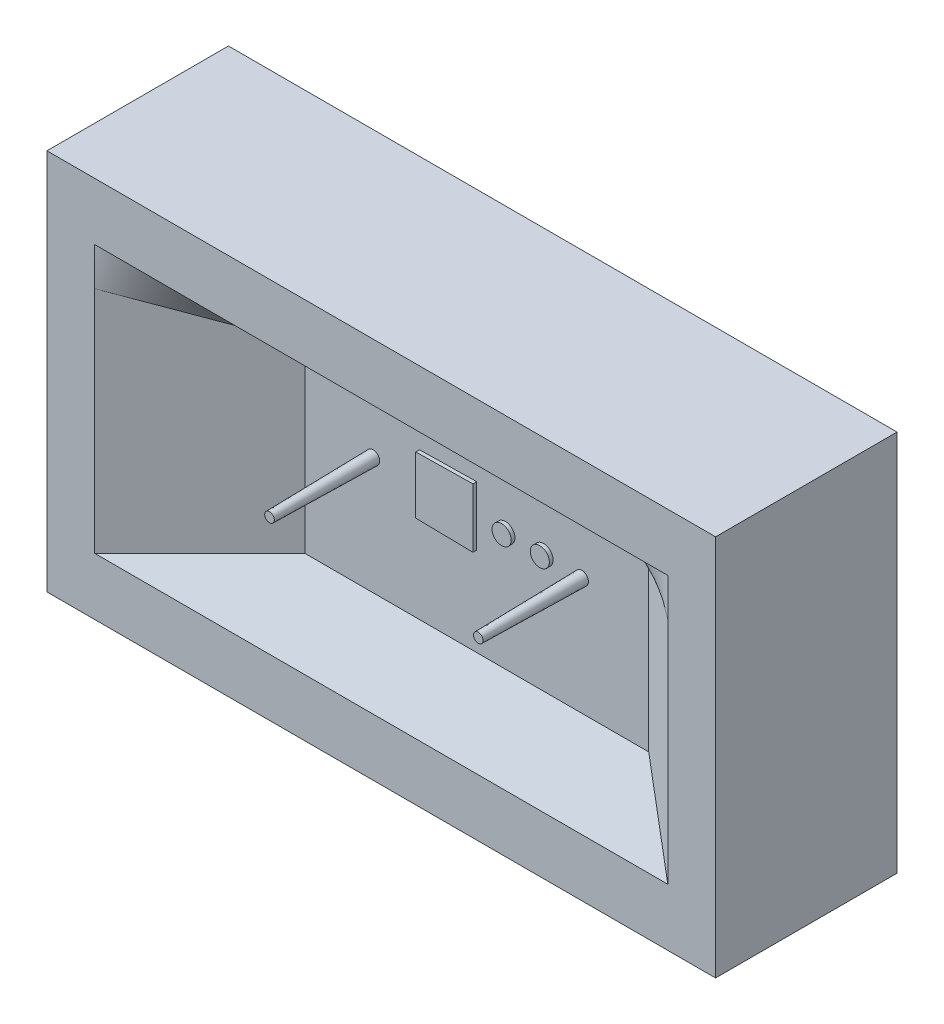
ISO-10303-21;
HEADER;
FILE_DESCRIPTION(('STEP AP214'),'2;1');
FILE_NAME('part.step','',(''),(''),'','','');
FILE_SCHEMA(('AUTOMOTIVE_DESIGN { 1 0 10303 214 1 1 1 1 }'));
ENDSEC;
DATA;
#1=APPLICATION_CONTEXT('core data for automotive mechanical design processes');
#2=APPLICATION_PROTOCOL_DEFINITION('international standard','automotive_design',2000,#1);
#3=PRODUCT_CONTEXT('',#1,'mechanical');
#4=PRODUCT('Part','Part','',(#3));
#5=PRODUCT_RELATED_PRODUCT_CATEGORY('part','',(#4));
#6=PRODUCT_DEFINITION_FORMATION('','',#4);
#7=PRODUCT_DEFINITION_CONTEXT('part definition',#1,'design');
#8=PRODUCT_DEFINITION('design','',#6,#7);
#9=PRODUCT_DEFINITION_SHAPE('','',#8);
#10=(LENGTH_UNIT() NAMED_UNIT(*) SI_UNIT(.MILLI.,.METRE.));
#11=(NAMED_UNIT(*) PLANE_ANGLE_UNIT() SI_UNIT($,.RADIAN.));
#12=(NAMED_UNIT(*) SI_UNIT($,.STERADIAN.) SOLID_ANGLE_UNIT());
#13=UNCERTAINTY_MEASURE_WITH_UNIT(LENGTH_MEASURE(1.E-05),#10,'distance_accuracy_value','');
#14=(GEOMETRIC_REPRESENTATION_CONTEXT(3) GLOBAL_UNCERTAINTY_ASSIGNED_CONTEXT((#13)) GLOBAL_UNIT_ASSIGNED_CONTEXT((#10,
#11,#12)) REPRESENTATION_CONTEXT('',''));
#15=CARTESIAN_POINT('',(0.,0.,0.));
#16=DIRECTION('',(0.,0.,1.));
#17=DIRECTION('',(1.,0.,0.));
#18=AXIS2_PLACEMENT_3D('',#15,#16,#17);
#19=CARTESIAN_POINT('',(-174.999999872721,29.9999996912032,47.0000000000001));
#20=DIRECTION('',(-1.,0.,0.));
#21=DIRECTION('',(0.,-1.,0.));
#22=AXIS2_PLACEMENT_3D('',#19,#20,#21);
#23=PLANE('',#22);
#24=DIRECTION('',(0.,-1.,0.));
#25=VECTOR('',#24,1.);
#26=CARTESIAN_POINT('',(-174.999999872721,29.9999996912033,1.11022302462516E-13));
#27=LINE('',#26,#25);
#28=CARTESIAN_POINT('',(-174.999999872721,29.9999996912032,1.11022302462516E-13));
#29=VERTEX_POINT('',#28);
#30=CARTESIAN_POINT('',(-174.999999872721,-170.000000308797,-6.03683769639929E-13));
#31=VERTEX_POINT('',#30);
#32=EDGE_CURVE('E243',#29,#31,#27,.T.);
#33=ORIENTED_EDGE('',*,*,#32,.F.);
#34=DIRECTION('',(0.,0.,-1.));
#35=VECTOR('',#34,1.);
#36=CARTESIAN_POINT('',(-174.999999872721,29.9999996912032,47.0000000000001));
#37=LINE('',#36,#35);
#38=CARTESIAN_POINT('',(-174.999999872721,29.9999996912032,-94.9999999999999));
#39=VERTEX_POINT('',#38);
#40=EDGE_CURVE('E198',#29,#39,#37,.T.);
#41=ORIENTED_EDGE('',*,*,#40,.T.);
#42=DIRECTION('',(0.,1.,0.));
#43=VECTOR('',#42,1.);
#44=CARTESIAN_POINT('',(-174.999999872721,29.9999996912032,-94.9999999999999));
#45=LINE('',#44,#43);
#46=CARTESIAN_POINT('',(-174.999999872721,-170.000000308797,-95.0000000000006));
#47=VERTEX_POINT('',#46);
#48=EDGE_CURVE('E256',#47,#39,#45,.T.);
#49=ORIENTED_EDGE('',*,*,#48,.F.);
#50=DIRECTION('',(0.,0.,-1.));
#51=VECTOR('',#50,1.);
#52=CARTESIAN_POINT('',(-174.999999872721,-170.000000308797,46.9999999999994));
#53=LINE('',#52,#51);
#54=EDGE_CURVE('E249',#31,#47,#53,.T.);
#55=ORIENTED_EDGE('',*,*,#54,.F.);
#56=EDGE_LOOP('',(#33,#41,#49,#55));
#57=FACE_BOUND('',#56,.T.);
#58=ADVANCED_FACE('F38',(#57),#23,.T.);
#59=CARTESIAN_POINT('',(-174.999999872721,-170.000000308797,46.9999999999994));
#60=DIRECTION('',(0.,-1.,0.));
#61=DIRECTION('',(1.,0.,0.));
#62=AXIS2_PLACEMENT_3D('',#59,#60,#61);
#63=PLANE('',#62);
#64=DIRECTION('',(1.,0.,0.));
#65=VECTOR('',#64,1.);
#66=CARTESIAN_POINT('',(-174.999999872721,-170.000000308797,-6.03683769639929E-13));
#67=LINE('',#66,#65);
#68=CARTESIAN_POINT('',(175.000000127279,-170.000000308797,-2.42861286636753E-13));
#69=VERTEX_POINT('',#68);
#70=EDGE_CURVE('E240',#31,#69,#67,.T.);
#71=ORIENTED_EDGE('',*,*,#70,.F.);
#72=ORIENTED_EDGE('',*,*,#54,.T.);
#73=DIRECTION('',(-1.,0.,0.));
#74=VECTOR('',#73,1.);
#75=CARTESIAN_POINT('',(-174.999999872721,-170.000000308797,-95.0000000000006));
#76=LINE('',#75,#74);
#77=CARTESIAN_POINT('',(175.000000127279,-170.000000308797,-95.0000000000006));
#78=VERTEX_POINT('',#77);
#79=EDGE_CURVE('E232',#78,#47,#76,.T.);
#80=ORIENTED_EDGE('',*,*,#79,.F.);
#81=DIRECTION('',(0.,0.,-1.));
#82=VECTOR('',#81,1.);
#83=CARTESIAN_POINT('',(175.000000127279,-170.000000308797,46.9999999999994));
#84=LINE('',#83,#82);
#85=EDGE_CURVE('E252',#69,#78,#84,.T.);
#86=ORIENTED_EDGE('',*,*,#85,.F.);
#87=EDGE_LOOP('',(#71,#72,#80,#86));
#88=FACE_BOUND('',#87,.T.);
#89=ADVANCED_FACE('F324',(#88),#63,.T.);
#90=CARTESIAN_POINT('',(175.000000127279,29.9999996912031,47.0000000000001));
#91=DIRECTION('',(1.,0.,0.));
#92=DIRECTION('',(0.,1.,0.));
#93=AXIS2_PLACEMENT_3D('',#90,#91,#92);
#94=PLANE('',#93);
#95=DIRECTION('',(0.,1.,0.));
#96=VECTOR('',#95,1.);
#97=CARTESIAN_POINT('',(175.000000127279,29.9999996912033,1.11022302462516E-13));
#98=LINE('',#97,#96);
#99=CARTESIAN_POINT('',(175.000000127279,29.9999996912031,1.11022302462516E-13));
#100=VERTEX_POINT('',#99);
#101=EDGE_CURVE('E50',#69,#100,#98,.T.);
#102=ORIENTED_EDGE('',*,*,#101,.F.);
#103=ORIENTED_EDGE('',*,*,#85,.T.);
#104=DIRECTION('',(0.,-1.,0.));
#105=VECTOR('',#104,1.);
#106=CARTESIAN_POINT('',(175.000000127279,29.9999996912031,-94.9999999999999));
#107=LINE('',#106,#105);
#108=CARTESIAN_POINT('',(175.000000127279,29.9999996912031,-94.9999999999999));
#109=VERTEX_POINT('',#108);
#110=EDGE_CURVE('E271',#109,#78,#107,.T.);
#111=ORIENTED_EDGE('',*,*,#110,.F.);
#112=DIRECTION('',(0.,0.,-1.));
#113=VECTOR('',#112,1.);
#114=CARTESIAN_POINT('',(175.000000127279,29.9999996912031,47.0000000000001));
#115=LINE('',#114,#113);
#116=EDGE_CURVE('E254',#100,#109,#115,.T.);
#117=ORIENTED_EDGE('',*,*,#116,.F.);
#118=EDGE_LOOP('',(#102,#103,#111,#117));
#119=FACE_BOUND('',#118,.T.);
#120=ADVANCED_FACE('F330',(#119),#94,.T.);
#121=CARTESIAN_POINT('',(-174.999999872721,29.9999996912032,47.0000000000001));
#122=DIRECTION('',(0.,1.,0.));
#123=DIRECTION('',(-1.,0.,0.));
#124=AXIS2_PLACEMENT_3D('',#121,#122,#123);
#125=PLANE('',#124);
#126=DIRECTION('',(-1.,0.,0.));
#127=VECTOR('',#126,1.);
#128=CARTESIAN_POINT('',(-174.999999872721,29.9999996912032,1.11022302462516E-13));
#129=LINE('',#128,#127);
#130=EDGE_CURVE('E246',#100,#29,#129,.T.);
#131=ORIENTED_EDGE('',*,*,#130,.F.);
#132=ORIENTED_EDGE('',*,*,#116,.T.);
#133=DIRECTION('',(1.,0.,0.));
#134=VECTOR('',#133,1.);
#135=CARTESIAN_POINT('',(-174.999999872721,29.9999996912032,-94.9999999999999));
#136=LINE('',#135,#134);
#137=EDGE_CURVE('E264',#39,#109,#136,.T.);
#138=ORIENTED_EDGE('',*,*,#137,.F.);
#139=ORIENTED_EDGE('',*,*,#40,.F.);
#140=EDGE_LOOP('',(#131,#132,#138,#139));
#141=FACE_BOUND('',#140,.T.);
#142=ADVANCED_FACE('F759',(#141),#125,.T.);
#143=CARTESIAN_POINT('',(0.,0.,-95.));
#144=DIRECTION('',(0.,0.,1.));
#145=DIRECTION('',(0.,-1.,0.));
#146=AXIS2_PLACEMENT_3D('',#143,#144,#145);
#147=PLANE('',#146);
#148=ORIENTED_EDGE('',*,*,#48,.T.);
#149=ORIENTED_EDGE('',*,*,#137,.T.);
#150=ORIENTED_EDGE('',*,*,#110,.T.);
#151=ORIENTED_EDGE('',*,*,#79,.T.);
#152=EDGE_LOOP('',(#148,#149,#150,#151));
#153=FACE_BOUND('',#152,.T.);
#154=ADVANCED_FACE('F340',(#153),#147,.F.);
#155=CARTESIAN_POINT('',(0.,0.,4.22143622850085));
#156=DIRECTION('',(0.,0.,1.));
#157=DIRECTION('',(1.,0.,0.));
#158=AXIS2_PLACEMENT_3D('',#155,#156,#157);
#159=PLANE('',#158);
#160=CARTESIAN_POINT('',(-54.2759001296374,-73.6409301068171,4.22143622850085));
#161=DIRECTION('',(0.,0.,1.));
#162=DIRECTION('',(1.,0.,0.));
#163=AXIS2_PLACEMENT_3D('',#160,#161,#162);
#164=CIRCLE('',#163,2.51152856001326);
#165=CARTESIAN_POINT('',(-51.7643715696241,-73.6409301068171,4.22143622850085));
#166=VERTEX_POINT('',#165);
#167=EDGE_CURVE('E164',#166,#166,#164,.F.);
#168=ORIENTED_EDGE('',*,*,#167,.F.);
#169=EDGE_LOOP('',(#168));
#170=FACE_BOUND('',#169,.T.);
#171=ADVANCED_FACE('F336',(#170),#159,.T.);
#172=CARTESIAN_POINT('',(59.0652003015943,-56.445361145891,-48.));
#173=DIRECTION('',(0.0174497483512505,-0.999695413509548,0.0174524064372835));
#174=DIRECTION('',(0.,-0.0174550641182922,-0.999847648762863));
#175=AXIS2_PLACEMENT_3D('',#172,#173,#174);
#176=PLANE('',#175);
#177=DIRECTION('',(0.0174498403013456,-0.0171479103059381,-0.999700681326965));
#178=VECTOR('',#177,1.);
#179=CARTESIAN_POINT('',(-29.9844401285903,-58.0152906430487,-48.8914244360414));
#180=LINE('',#179,#178);
#181=CARTESIAN_POINT('',(-30.,-58.,-48.));
#182=VERTEX_POINT('',#181);
#183=CARTESIAN_POINT('',(-29.9650898701436,-58.0343060890649,-50.));
#184=VERTEX_POINT('',#183);
#185=EDGE_CURVE('E182',#182,#184,#180,.T.);
#186=ORIENTED_EDGE('',*,*,#185,.F.);
#187=DIRECTION('',(-0.999847695156391,-0.0174524064372835,0.));
#188=VECTOR('',#187,1.);
#189=CARTESIAN_POINT('',(59.0652003015943,-56.445361145891,-48.));
#190=LINE('',#189,#188);
#191=CARTESIAN_POINT('',(0.,-57.4763480521535,-48.));
#192=VERTEX_POINT('',#191);
#193=EDGE_CURVE('E228',#182,#192,#190,.F.);
#194=ORIENTED_EDGE('',*,*,#193,.T.);
#195=DIRECTION('',(-0.0174496547837706,-0.0177568977127763,-0.999690053032211));
#196=VECTOR('',#195,1.);
#197=CARTESIAN_POINT('',(0.0183042426233904,-57.4577215195371,-46.9513506424258));
#198=LINE('',#197,#196);
#199=CARTESIAN_POINT('',(-0.0349101298564354,-57.511872858385,-50.));
#200=VERTEX_POINT('',#199);
#201=EDGE_CURVE('E225',#192,#200,#198,.T.);
#202=ORIENTED_EDGE('',*,*,#201,.T.);
#203=DIRECTION('',(-0.999847695156391,-0.0174524064372835,0.));
#204=VECTOR('',#203,1.);
#205=CARTESIAN_POINT('',(59.0658095673693,-56.4802659587655,-50.));
#206=LINE('',#205,#204);
#207=EDGE_CURVE('E187',#184,#200,#206,.F.);
#208=ORIENTED_EDGE('',*,*,#207,.F.);
#209=EDGE_LOOP('',(#186,#194,#202,#208));
#210=FACE_BOUND('',#209,.T.);
#211=ADVANCED_FACE('F339',(#210),#176,.F.);
#212=CARTESIAN_POINT('',(0.,-110.,-48.));
#213=DIRECTION('',(-0.999847695156391,0.,0.0174524064372835));
#214=DIRECTION('',(0.0174524064372835,0.,0.999847695156391));
#215=AXIS2_PLACEMENT_3D('',#212,#213,#214);
#216=PLANE('',#215);
#217=ORIENTED_EDGE('',*,*,#201,.F.);
#218=DIRECTION('',(0.,-1.,0.));
#219=VECTOR('',#218,1.);
#220=CARTESIAN_POINT('',(0.,-110.,-48.));
#221=LINE('',#220,#219);
#222=CARTESIAN_POINT('',(0.,-88.5236519478465,-48.));
#223=VERTEX_POINT('',#222);
#224=EDGE_CURVE('E216',#192,#223,#221,.T.);
#225=ORIENTED_EDGE('',*,*,#224,.T.);
#226=DIRECTION('',(-0.0174496547837706,0.0177568977127763,-0.999690053032211));
#227=VECTOR('',#226,1.);
#228=CARTESIAN_POINT('',(0.00665448370796812,-88.5304235996642,-47.6187648836978));
#229=LINE('',#228,#227);
#230=CARTESIAN_POINT('',(-0.0349101298564394,-88.488127141615,-50.));
#231=VERTEX_POINT('',#230);
#232=EDGE_CURVE('E210',#223,#231,#229,.T.);
#233=ORIENTED_EDGE('',*,*,#232,.T.);
#234=DIRECTION('',(0.,1.,0.));
#235=VECTOR('',#234,1.);
#236=CARTESIAN_POINT('',(-0.0349101298564441,-110.,-50.));
#237=LINE('',#236,#235);
#238=EDGE_CURVE('E211',#200,#231,#237,.F.);
#239=ORIENTED_EDGE('',*,*,#238,.F.);
#240=EDGE_LOOP('',(#217,#225,#233,#239));
#241=FACE_BOUND('',#240,.T.);
#242=ADVANCED_FACE('F344',(#241),#216,.F.);
#243=CARTESIAN_POINT('',(60.3564816795868,-89.5771782544025,-48.));
#244=DIRECTION('',(0.0174497483512505,0.999695413509548,0.0174524064372835));
#245=DIRECTION('',(0.,-0.0174550641182922,0.999847648762863));
#246=AXIS2_PLACEMENT_3D('',#243,#244,#245);
#247=PLANE('',#246);
#248=ORIENTED_EDGE('',*,*,#232,.F.);
#249=DIRECTION('',(0.999847695156391,-0.0174524064372835,0.));
#250=VECTOR('',#249,1.);
#251=CARTESIAN_POINT('',(60.3564816795868,-89.5771782544025,-48.));
#252=LINE('',#251,#250);
#253=CARTESIAN_POINT('',(-30.,-88.,-48.));
#254=VERTEX_POINT('',#253);
#255=EDGE_CURVE('E206',#223,#254,#252,.F.);
#256=ORIENTED_EDGE('',*,*,#255,.T.);
#257=DIRECTION('',(0.0174498403013456,0.0171479103059381,-0.999700681326965));
#258=VECTOR('',#257,1.);
#259=CARTESIAN_POINT('',(-29.9729586653975,-87.9734265544951,-49.5491970218237));
#260=LINE('',#259,#258);
#261=CARTESIAN_POINT('',(-29.9650898701436,-87.9656939109351,-50.));
#262=VERTEX_POINT('',#261);
#263=EDGE_CURVE('E193',#254,#262,#260,.T.);
#264=ORIENTED_EDGE('',*,*,#263,.T.);
#265=DIRECTION('',(0.999847695156391,-0.0174524064372835,0.));
#266=VECTOR('',#265,1.);
#267=CARTESIAN_POINT('',(60.3570909453619,-89.5422734415279,-50.));
#268=LINE('',#267,#266);
#269=EDGE_CURVE('E154',#231,#262,#268,.F.);
#270=ORIENTED_EDGE('',*,*,#269,.F.);
#271=EDGE_LOOP('',(#248,#256,#264,#270));
#272=FACE_BOUND('',#271,.T.);
#273=ADVANCED_FACE('F348',(#272),#247,.F.);
#274=CARTESIAN_POINT('',(-30.,-110.,-48.));
#275=DIRECTION('',(0.999847695156391,0.,0.0174524064372835));
#276=DIRECTION('',(0.0174524064372835,0.,-0.999847695156391));
#277=AXIS2_PLACEMENT_3D('',#274,#275,#276);
#278=PLANE('',#277);
#279=ORIENTED_EDGE('',*,*,#263,.F.);
#280=DIRECTION('',(0.,1.,0.));
#281=VECTOR('',#280,1.);
#282=CARTESIAN_POINT('',(-30.,-110.,-48.));
#283=LINE('',#282,#281);
#284=EDGE_CURVE('E188',#254,#182,#283,.T.);
#285=ORIENTED_EDGE('',*,*,#284,.T.);
#286=ORIENTED_EDGE('',*,*,#185,.T.);
#287=DIRECTION('',(0.,-1.,0.));
#288=VECTOR('',#287,1.);
#289=CARTESIAN_POINT('',(-29.9650898701436,-110.,-50.));
#290=LINE('',#289,#288);
#291=EDGE_CURVE('E185',#262,#184,#290,.F.);
#292=ORIENTED_EDGE('',*,*,#291,.F.);
#293=EDGE_LOOP('',(#279,#285,#286,#292));
#294=FACE_BOUND('',#293,.T.);
#295=ADVANCED_FACE('F352',(#294),#278,.F.);
#296=CARTESIAN_POINT('',(35.,-73.,-48.));
#297=DIRECTION('',(0.,0.,1.));
#298=DIRECTION('',(-1.,0.,0.));
#299=AXIS2_PLACEMENT_3D('',#296,#297,#298);
#300=CONICAL_SURFACE('',#299,5.,0.0174532925199433);
#301=CARTESIAN_POINT('',(35.,-73.,-50.));
#302=DIRECTION('',(0.,0.,-1.));
#303=DIRECTION('',(-1.,0.,0.));
#304=AXIS2_PLACEMENT_3D('',#301,#302,#303);
#305=CIRCLE('',#304,4.96508987014356);
#306=CARTESIAN_POINT('',(30.0349101298564,-73.,-50.));
#307=VERTEX_POINT('',#306);
#308=EDGE_CURVE('E178',#307,#307,#305,.T.);
#309=ORIENTED_EDGE('',*,*,#308,.F.);
#310=EDGE_LOOP('',(#309));
#311=FACE_BOUND('',#310,.T.);
#312=CARTESIAN_POINT('',(35.,-73.,-48.));
#313=DIRECTION('',(0.,0.,-1.));
#314=DIRECTION('',(-1.,0.,0.));
#315=AXIS2_PLACEMENT_3D('',#312,#313,#314);
#316=CIRCLE('',#315,5.);
#317=CARTESIAN_POINT('',(30.,-73.,-48.));
#318=VERTEX_POINT('',#317);
#319=EDGE_CURVE('E175',#318,#318,#316,.T.);
#320=ORIENTED_EDGE('',*,*,#319,.T.);
#321=EDGE_LOOP('',(#320));
#322=FACE_BOUND('',#321,.T.);
#323=ADVANCED_FACE('F356',(#311,#322),#300,.T.);
#324=CARTESIAN_POINT('',(15.,-73.,-48.));
#325=DIRECTION('',(0.,0.,1.));
#326=DIRECTION('',(-1.,0.,0.));
#327=AXIS2_PLACEMENT_3D('',#324,#325,#326);
#328=CONICAL_SURFACE('',#327,5.,0.0174532925199433);
#329=CARTESIAN_POINT('',(15.,-73.,-50.));
#330=DIRECTION('',(0.,0.,-1.));
#331=DIRECTION('',(-1.,0.,0.));
#332=AXIS2_PLACEMENT_3D('',#329,#330,#331);
#333=CIRCLE('',#332,4.96508987014357);
#334=CARTESIAN_POINT('',(10.0349101298564,-73.,-50.));
#335=VERTEX_POINT('',#334);
#336=EDGE_CURVE('E170',#335,#335,#333,.T.);
#337=ORIENTED_EDGE('',*,*,#336,.F.);
#338=EDGE_LOOP('',(#337));
#339=FACE_BOUND('',#338,.T.);
#340=CARTESIAN_POINT('',(15.,-73.,-48.));
#341=DIRECTION('',(0.,0.,-1.));
#342=DIRECTION('',(-1.,0.,0.));
#343=AXIS2_PLACEMENT_3D('',#340,#341,#342);
#344=CIRCLE('',#343,5.);
#345=CARTESIAN_POINT('',(9.99999999999999,-73.,-48.));
#346=VERTEX_POINT('',#345);
#347=EDGE_CURVE('E171',#346,#346,#344,.T.);
#348=ORIENTED_EDGE('',*,*,#347,.T.);
#349=EDGE_LOOP('',(#348));
#350=FACE_BOUND('',#349,.T.);
#351=ADVANCED_FACE('F360',(#339,#350),#328,.T.);
#352=CARTESIAN_POINT('',(-54.2759001296374,-73.6409301068171,4.88190698931831));
#353=DIRECTION('',(0.,0.,-1.));
#354=DIRECTION('',(0.894427190999916,-0.447213595499958,0.));
#355=AXIS2_PLACEMENT_3D('',#352,#353,#354);
#356=CONICAL_SURFACE('',#355,2.5,0.0174532925199433);
#357=CARTESIAN_POINT('',(-54.2759001296374,-73.6409301068171,-50.));
#358=DIRECTION('',(0.,0.,-1.));
#359=DIRECTION('',(-1.,0.,0.));
#360=AXIS2_PLACEMENT_3D('',#357,#358,#359);
#361=CIRCLE('',#360,3.45796724988295);
#362=CARTESIAN_POINT('',(-57.7338673795203,-73.6409301068171,-50.));
#363=VERTEX_POINT('',#362);
#364=EDGE_CURVE('E167',#363,#363,#361,.T.);
#365=ORIENTED_EDGE('',*,*,#364,.F.);
#366=EDGE_LOOP('',(#365));
#367=FACE_BOUND('',#366,.T.);
#368=ORIENTED_EDGE('',*,*,#167,.T.);
#369=EDGE_LOOP('',(#368));
#370=FACE_BOUND('',#369,.T.);
#371=ADVANCED_FACE('F364',(#367,#370),#356,.T.);
#372=CARTESIAN_POINT('',(55.,-73.6409301068171,4.88190698931831));
#373=DIRECTION('',(0.,0.,-1.));
#374=DIRECTION('',(0.894427190999916,-0.447213595499958,0.));
#375=AXIS2_PLACEMENT_3D('',#372,#373,#374);
#376=CONICAL_SURFACE('',#375,2.5,0.0174532925199433);
#377=CARTESIAN_POINT('',(55.,-73.6409301068171,-50.));
#378=DIRECTION('',(0.,0.,-1.));
#379=DIRECTION('',(-1.,0.,0.));
#380=AXIS2_PLACEMENT_3D('',#377,#378,#379);
#381=CIRCLE('',#380,3.45796724988295);
#382=CARTESIAN_POINT('',(51.542032750117,-73.6409301068171,-50.));
#383=VERTEX_POINT('',#382);
#384=EDGE_CURVE('E163',#383,#383,#381,.T.);
#385=ORIENTED_EDGE('',*,*,#384,.F.);
#386=EDGE_LOOP('',(#385));
#387=FACE_BOUND('',#386,.T.);
#388=CARTESIAN_POINT('',(55.,-73.6409301068171,4.22143622850085));
#389=DIRECTION('',(0.,0.,-1.));
#390=DIRECTION('',(-1.,0.,0.));
#391=AXIS2_PLACEMENT_3D('',#388,#389,#390);
#392=CIRCLE('',#391,2.51152856001326);
#393=CARTESIAN_POINT('',(52.4884714399867,-73.6409301068171,4.22143622850085));
#394=VERTEX_POINT('',#393);
#395=EDGE_CURVE('E159',#394,#394,#392,.T.);
#396=ORIENTED_EDGE('',*,*,#395,.T.);
#397=EDGE_LOOP('',(#396));
#398=FACE_BOUND('',#397,.T.);
#399=ADVANCED_FACE('F368',(#387,#398),#376,.T.);
#400=CARTESIAN_POINT('',(60.,-110.,-50.));
#401=DIRECTION('',(0.,0.,-1.));
#402=DIRECTION('',(-1.,0.,0.));
#403=AXIS2_PLACEMENT_3D('',#400,#401,#402);
#404=PLANE('',#403);
#405=ORIENTED_EDGE('',*,*,#384,.T.);
#406=EDGE_LOOP('',(#405));
#407=FACE_BOUND('',#406,.T.);
#408=ORIENTED_EDGE('',*,*,#364,.T.);
#409=EDGE_LOOP('',(#408));
#410=FACE_BOUND('',#409,.T.);
#411=ORIENTED_EDGE('',*,*,#336,.T.);
#412=EDGE_LOOP('',(#411));
#413=FACE_BOUND('',#412,.T.);
#414=ORIENTED_EDGE('',*,*,#308,.T.);
#415=EDGE_LOOP('',(#414));
#416=FACE_BOUND('',#415,.T.);
#417=ORIENTED_EDGE('',*,*,#291,.T.);
#418=ORIENTED_EDGE('',*,*,#207,.T.);
#419=ORIENTED_EDGE('',*,*,#238,.T.);
#420=ORIENTED_EDGE('',*,*,#269,.T.);
#421=EDGE_LOOP('',(#417,#418,#419,#420));
#422=FACE_BOUND('',#421,.T.);
#423=DIRECTION('',(-1.,0.,0.));
#424=VECTOR('',#423,1.);
#425=CARTESIAN_POINT('',(75.,-135.,-50.));
#426=LINE('',#425,#424);
#427=CARTESIAN_POINT('',(90.,-135.,-50.));
#428=VERTEX_POINT('',#427);
#429=CARTESIAN_POINT('',(-90.,-135.,-50.));
#430=VERTEX_POINT('',#429);
#431=EDGE_CURVE('E155',#428,#430,#426,.T.);
#432=ORIENTED_EDGE('',*,*,#431,.F.);
#433=DIRECTION('',(0.,1.,0.));
#434=VECTOR('',#433,1.);
#435=CARTESIAN_POINT('',(90.,-87.5,-50.));
#436=LINE('',#435,#434);
#437=CARTESIAN_POINT('',(90.,-40.,-50.));
#438=VERTEX_POINT('',#437);
#439=EDGE_CURVE('E152',#428,#438,#436,.T.);
#440=ORIENTED_EDGE('',*,*,#439,.T.);
#441=DIRECTION('',(-1.,0.,0.));
#442=VECTOR('',#441,1.);
#443=CARTESIAN_POINT('',(0.,-40.,-50.));
#444=LINE('',#443,#442);
#445=CARTESIAN_POINT('',(-90.,-40.,-50.));
#446=VERTEX_POINT('',#445);
#447=EDGE_CURVE('E124',#438,#446,#444,.T.);
#448=ORIENTED_EDGE('',*,*,#447,.T.);
#449=DIRECTION('',(0.,1.,0.));
#450=VECTOR('',#449,1.);
#451=CARTESIAN_POINT('',(-90.,-87.5,-50.));
#452=LINE('',#451,#450);
#453=EDGE_CURVE('E146',#430,#446,#452,.T.);
#454=ORIENTED_EDGE('',*,*,#453,.F.);
#455=EDGE_LOOP('',(#432,#440,#448,#454));
#456=FACE_BOUND('',#455,.T.);
#457=ADVANCED_FACE('F303',(#407,#410,#413,#416,#422,#456),#404,.F.);
#458=CARTESIAN_POINT('',(90.,-40.,-50.));
#459=DIRECTION('',(0.,0.581238193719097,-0.813733471206735));
#460=DIRECTION('',(-1.,0.,0.));
#461=AXIS2_PLACEMENT_3D('',#458,#459,#460);
#462=PLANE('',#461);
#463=ORIENTED_EDGE('',*,*,#447,.F.);
#464=DIRECTION('',(-0.329292779969071,0.768349819927832,0.548821299948452));
#465=VECTOR('',#464,1.);
#466=CARTESIAN_POINT('',(82.5,-22.5,-37.5));
#467=LINE('',#466,#465);
#468=CARTESIAN_POINT('',(75.,-5.,-25.));
#469=VERTEX_POINT('',#468);
#470=EDGE_CURVE('E117',#438,#469,#467,.T.);
#471=ORIENTED_EDGE('',*,*,#470,.T.);
#472=DIRECTION('',(-1.,0.,0.));
#473=VECTOR('',#472,1.);
#474=CARTESIAN_POINT('',(0.,-5.00000000000001,-25.));
#475=LINE('',#474,#473);
#476=CARTESIAN_POINT('',(-75.,-5.00000000000002,-25.));
#477=VERTEX_POINT('',#476);
#478=EDGE_CURVE('E122',#469,#477,#475,.T.);
#479=ORIENTED_EDGE('',*,*,#478,.T.);
#480=DIRECTION('',(0.32929277996907,0.768349819927832,0.548821299948452));
#481=VECTOR('',#480,1.);
#482=CARTESIAN_POINT('',(-82.5,-22.5,-37.5));
#483=LINE('',#482,#481);
#484=EDGE_CURVE('E144',#446,#477,#483,.T.);
#485=ORIENTED_EDGE('',*,*,#484,.F.);
#486=EDGE_LOOP('',(#463,#471,#479,#485));
#487=FACE_BOUND('',#486,.T.);
#488=ADVANCED_FACE('F119',(#487),#462,.F.);
#489=CARTESIAN_POINT('',(150.,0.,0.));
#490=DIRECTION('',(0.,-0.98058067569092,0.196116135138186));
#491=DIRECTION('',(-1.,0.,0.));
#492=AXIS2_PLACEMENT_3D('',#489,#490,#491);
#493=PLANE('',#492);
#494=DIRECTION('',(-1.,0.,0.));
#495=VECTOR('',#494,1.);
#496=CARTESIAN_POINT('',(0.,0.,0.));
#497=LINE('',#496,#495);
#498=CARTESIAN_POINT('',(150.,0.,0.));
#499=VERTEX_POINT('',#498);
#500=CARTESIAN_POINT('',(-150.,0.,0.));
#501=VERTEX_POINT('',#500);
#502=EDGE_CURVE('E59',#499,#501,#497,.T.);
#503=ORIENTED_EDGE('',*,*,#502,.T.);
#504=DIRECTION('',(0.946791604646705,-0.0631194403097805,-0.315597201548902));
#505=VECTOR('',#504,1.);
#506=CARTESIAN_POINT('',(-112.5,-2.50000000000001,-12.5));
#507=LINE('',#506,#505);
#508=EDGE_CURVE('E135',#501,#477,#507,.T.);
#509=ORIENTED_EDGE('',*,*,#508,.T.);
#510=ORIENTED_EDGE('',*,*,#478,.F.);
#511=DIRECTION('',(0.946791604646705,0.063119440309781,0.315597201548902));
#512=VECTOR('',#511,1.);
#513=CARTESIAN_POINT('',(112.5,-2.49999999999997,-12.5));
#514=LINE('',#513,#512);
#515=EDGE_CURVE('E130',#469,#499,#514,.T.);
#516=ORIENTED_EDGE('',*,*,#515,.T.);
#517=EDGE_LOOP('',(#503,#509,#510,#516));
#518=FACE_BOUND('',#517,.T.);
#519=ADVANCED_FACE('F137',(#518),#493,.T.);
#520=CARTESIAN_POINT('',(-75.,-5.00000000000002,-25.));
#521=CARTESIAN_POINT('',(-90.,-40.,-50.));
#522=CARTESIAN_POINT('',(-150.,0.,0.));
#523=CARTESIAN_POINT('',(-150.,-20.,0.));
#524=B_SPLINE_SURFACE_WITH_KNOTS('',1,1,((#520,#521),(#522,#523)),.UNSPECIFIED.,.F.,.F.,.F.,(2,
2),(2,2),(0.,1.),(0.,1.),.UNSPECIFIED.);
#525=DIRECTION('',(0.,-1.,0.));
#526=VECTOR('',#525,1.);
#527=CARTESIAN_POINT('',(-150.,-10.,0.));
#528=LINE('',#527,#526);
#529=CARTESIAN_POINT('',(-150.,-20.,0.));
#530=VERTEX_POINT('',#529);
#531=EDGE_CURVE('E134',#501,#530,#528,.T.);
#532=DIRECTION('',(-0.744208407535251,0.248069469178417,0.620173672946042));
#533=VECTOR('',#532,1.);
#534=CARTESIAN_POINT('',(-120.,-30.,-25.));
#535=LINE('',#534,#533);
#536=EDGE_CURVE('E288',#446,#530,#535,.T.);
#537=ORIENTED_EDGE('',*,*,#508,.F.);
#538=ORIENTED_EDGE('',*,*,#531,.T.);
#539=ORIENTED_EDGE('',*,*,#536,.F.);
#540=ORIENTED_EDGE('',*,*,#484,.T.);
#541=EDGE_LOOP('',(#537,#538,#539,#540));
#542=FACE_BOUND('',#541,.T.);
#543=ADVANCED_FACE('F299',(#542),#524,.T.);
#544=CARTESIAN_POINT('',(-150.,-20.,0.));
#545=DIRECTION('',(-0.64018439966448,0.,-0.768221279597376));
#546=DIRECTION('',(0.744208407535251,-0.248069469178417,-0.620173672946042));
#547=AXIS2_PLACEMENT_3D('',#544,#545,#546);
#548=PLANE('',#547);
#549=ORIENTED_EDGE('',*,*,#536,.T.);
#550=DIRECTION('',(0.,-1.,0.));
#551=VECTOR('',#550,1.);
#552=CARTESIAN_POINT('',(-150.,-80.,0.));
#553=LINE('',#552,#551);
#554=CARTESIAN_POINT('',(-150.,-140.,0.));
#555=VERTEX_POINT('',#554);
#556=EDGE_CURVE('E284',#530,#555,#553,.T.);
#557=ORIENTED_EDGE('',*,*,#556,.T.);
#558=DIRECTION('',(0.766651877999928,0.0638876564999944,-0.63887656499994));
#559=VECTOR('',#558,1.);
#560=CARTESIAN_POINT('',(-120.,-137.5,-25.));
#561=LINE('',#560,#559);
#562=EDGE_CURVE('E150',#555,#430,#561,.T.);
#563=ORIENTED_EDGE('',*,*,#562,.T.);
#564=ORIENTED_EDGE('',*,*,#453,.T.);
#565=EDGE_LOOP('',(#549,#557,#563,#564));
#566=FACE_BOUND('',#565,.T.);
#567=ADVANCED_FACE('F314',(#566),#548,.F.);
#568=CARTESIAN_POINT('',(150.,-140.,0.));
#569=DIRECTION('',(0.,-0.995037190209989,-0.0995037190209991));
#570=DIRECTION('',(-1.,0.,0.));
#571=AXIS2_PLACEMENT_3D('',#568,#569,#570);
#572=PLANE('',#571);
#573=DIRECTION('',(-1.,0.,0.));
#574=VECTOR('',#573,1.);
#575=CARTESIAN_POINT('',(0.,-140.,0.));
#576=LINE('',#575,#574);
#577=CARTESIAN_POINT('',(150.,-140.,0.));
#578=VERTEX_POINT('',#577);
#579=EDGE_CURVE('E11',#578,#555,#576,.T.);
#580=ORIENTED_EDGE('',*,*,#579,.F.);
#581=DIRECTION('',(-0.766651877999928,0.0638876564999937,-0.63887656499994));
#582=VECTOR('',#581,1.);
#583=CARTESIAN_POINT('',(120.,-137.5,-25.));
#584=LINE('',#583,#582);
#585=EDGE_CURVE('E149',#578,#428,#584,.T.);
#586=ORIENTED_EDGE('',*,*,#585,.T.);
#587=ORIENTED_EDGE('',*,*,#431,.T.);
#588=ORIENTED_EDGE('',*,*,#562,.F.);
#589=EDGE_LOOP('',(#580,#586,#587,#588));
#590=FACE_BOUND('',#589,.T.);
#591=ADVANCED_FACE('F312',(#590),#572,.F.);
#592=CARTESIAN_POINT('',(150.,-20.,0.));
#593=DIRECTION('',(-0.64018439966448,0.,0.768221279597376));
#594=DIRECTION('',(-0.744208407535251,-0.248069469178417,-0.620173672946042));
#595=AXIS2_PLACEMENT_3D('',#592,#593,#594);
#596=PLANE('',#595);
#597=DIRECTION('',(0.744208407535251,0.248069469178417,0.620173672946042));
#598=VECTOR('',#597,1.);
#599=CARTESIAN_POINT('',(120.,-30.,-25.0000000000001));
#600=LINE('',#599,#598);
#601=CARTESIAN_POINT('',(150.,-20.,0.));
#602=VERTEX_POINT('',#601);
#603=EDGE_CURVE('E277',#438,#602,#600,.T.);
#604=ORIENTED_EDGE('',*,*,#603,.F.);
#605=ORIENTED_EDGE('',*,*,#439,.F.);
#606=ORIENTED_EDGE('',*,*,#585,.F.);
#607=DIRECTION('',(0.,1.,0.));
#608=VECTOR('',#607,1.);
#609=CARTESIAN_POINT('',(150.,-80.,0.));
#610=LINE('',#609,#608);
#611=EDGE_CURVE('E158',#578,#602,#610,.T.);
#612=ORIENTED_EDGE('',*,*,#611,.T.);
#613=EDGE_LOOP('',(#604,#605,#606,#612));
#614=FACE_BOUND('',#613,.T.);
#615=ADVANCED_FACE('F308',(#614),#596,.T.);
#616=CARTESIAN_POINT('',(90.,-40.,-50.));
#617=CARTESIAN_POINT('',(75.,-5.,-25.));
#618=CARTESIAN_POINT('',(150.,-20.,0.));
#619=CARTESIAN_POINT('',(150.,0.,0.));
#620=B_SPLINE_SURFACE_WITH_KNOTS('',1,1,((#616,#617),(#618,#619)),.UNSPECIFIED.,.F.,.F.,.F.,(2,
2),(2,2),(0.,1.),(0.,1.),.UNSPECIFIED.);
#621=DIRECTION('',(0.,1.,0.));
#622=VECTOR('',#621,1.);
#623=CARTESIAN_POINT('',(150.,-9.99999999999997,0.));
#624=LINE('',#623,#622);
#625=EDGE_CURVE('E132',#602,#499,#624,.T.);
#626=ORIENTED_EDGE('',*,*,#603,.T.);
#627=ORIENTED_EDGE('',*,*,#625,.T.);
#628=ORIENTED_EDGE('',*,*,#515,.F.);
#629=ORIENTED_EDGE('',*,*,#470,.F.);
#630=EDGE_LOOP('',(#626,#627,#628,#629));
#631=FACE_BOUND('',#630,.T.);
#632=ADVANCED_FACE('F131',(#631),#620,.T.);
#633=CARTESIAN_POINT('',(0.,0.,-48.));
#634=DIRECTION('',(0.,0.,-1.));
#635=DIRECTION('',(-1.,0.,0.));
#636=AXIS2_PLACEMENT_3D('',#633,#634,#635);
#637=PLANE('',#636);
#638=ORIENTED_EDGE('',*,*,#255,.F.);
#639=ORIENTED_EDGE('',*,*,#224,.F.);
#640=ORIENTED_EDGE('',*,*,#193,.F.);
#641=ORIENTED_EDGE('',*,*,#284,.F.);
#642=EDGE_LOOP('',(#638,#639,#640,#641));
#643=FACE_BOUND('',#642,.T.);
#644=ADVANCED_FACE('F429',(#643),#637,.F.);
#645=CARTESIAN_POINT('',(0.,0.,-48.));
#646=DIRECTION('',(0.,0.,1.));
#647=DIRECTION('',(1.,0.,0.));
#648=AXIS2_PLACEMENT_3D('',#645,#646,#647);
#649=PLANE('',#648);
#650=ORIENTED_EDGE('',*,*,#319,.F.);
#651=EDGE_LOOP('',(#650));
#652=FACE_BOUND('',#651,.T.);
#653=ADVANCED_FACE('F438',(#652),#649,.T.);
#654=CARTESIAN_POINT('',(0.,0.,-48.));
#655=DIRECTION('',(0.,0.,1.));
#656=DIRECTION('',(1.,0.,0.));
#657=AXIS2_PLACEMENT_3D('',#654,#655,#656);
#658=PLANE('',#657);
#659=ORIENTED_EDGE('',*,*,#347,.F.);
#660=EDGE_LOOP('',(#659));
#661=FACE_BOUND('',#660,.T.);
#662=ADVANCED_FACE('F449',(#661),#658,.T.);
#663=CARTESIAN_POINT('',(0.,0.,4.22143622850085));
#664=DIRECTION('',(0.,0.,1.));
#665=DIRECTION('',(1.,0.,0.));
#666=AXIS2_PLACEMENT_3D('',#663,#664,#665);
#667=PLANE('',#666);
#668=ORIENTED_EDGE('',*,*,#395,.F.);
#669=EDGE_LOOP('',(#668));
#670=FACE_BOUND('',#669,.T.);
#671=ADVANCED_FACE('F460',(#670),#667,.T.);
#672=CARTESIAN_POINT('',(150.,-20.,0.));
#673=DIRECTION('',(0.,0.,-1.));
#674=DIRECTION('',(0.,1.,0.));
#675=AXIS2_PLACEMENT_3D('',#672,#673,#674);
#676=PLANE('',#675);
#677=ORIENTED_EDGE('',*,*,#130,.T.);
#678=ORIENTED_EDGE('',*,*,#32,.T.);
#679=ORIENTED_EDGE('',*,*,#70,.T.);
#680=ORIENTED_EDGE('',*,*,#101,.T.);
#681=EDGE_LOOP('',(#677,#678,#679,#680));
#682=FACE_BOUND('',#681,.T.);
#683=ORIENTED_EDGE('',*,*,#625,.F.);
#684=ORIENTED_EDGE('',*,*,#611,.F.);
#685=ORIENTED_EDGE('',*,*,#579,.T.);
#686=ORIENTED_EDGE('',*,*,#556,.F.);
#687=ORIENTED_EDGE('',*,*,#531,.F.);
#688=ORIENTED_EDGE('',*,*,#502,.F.);
#689=EDGE_LOOP('',(#683,#684,#685,#686,#687,#688));
#690=FACE_BOUND('',#689,.T.);
#691=ADVANCED_FACE('F40',(#682,#690),#676,.F.);
#692=CLOSED_SHELL('',(#58,#89,#120,#142,#154,#171,#211,#242,#273,#295,#323,#351,#371,#399,#457,
#488,#519,#543,#567,#591,#615,#632,#644,#653,#662,#671,#691));
#693=MANIFOLD_SOLID_BREP('B2',#692);
#694=ADVANCED_BREP_SHAPE_REPRESENTATION('',(#18,#693),#14);
#695=SHAPE_DEFINITION_REPRESENTATION(#9,#694);
ENDSEC;
END-ISO-10303-21;
